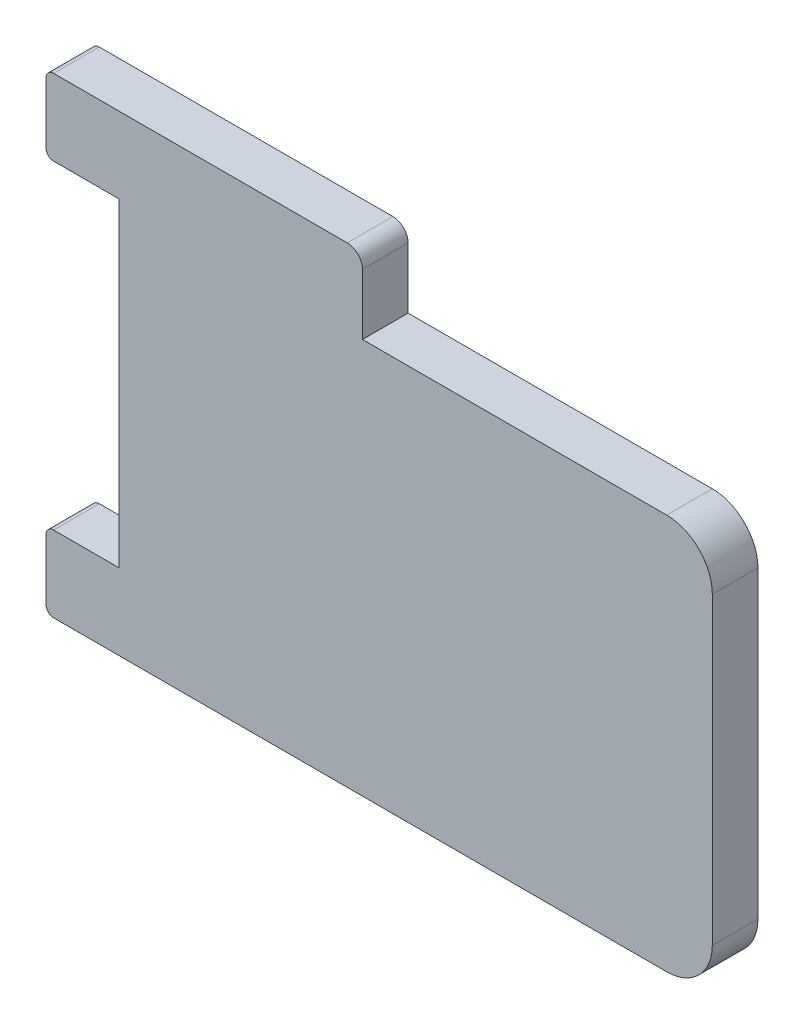
ISO-10303-21;
HEADER;
FILE_DESCRIPTION(('STEP AP214'),'2;1');
FILE_NAME('part.step','',(''),(''),'','','');
FILE_SCHEMA(('AUTOMOTIVE_DESIGN { 1 0 10303 214 1 1 1 1 }'));
ENDSEC;
DATA;
#1=APPLICATION_CONTEXT('core data for automotive mechanical design processes');
#2=APPLICATION_PROTOCOL_DEFINITION('international standard','automotive_design',2000,#1);
#3=PRODUCT_CONTEXT('',#1,'mechanical');
#4=PRODUCT('Part','Part','',(#3));
#5=PRODUCT_RELATED_PRODUCT_CATEGORY('part','',(#4));
#6=PRODUCT_DEFINITION_FORMATION('','',#4);
#7=PRODUCT_DEFINITION_CONTEXT('part definition',#1,'design');
#8=PRODUCT_DEFINITION('design','',#6,#7);
#9=PRODUCT_DEFINITION_SHAPE('','',#8);
#10=(LENGTH_UNIT() NAMED_UNIT(*) SI_UNIT(.MILLI.,.METRE.));
#11=(NAMED_UNIT(*) PLANE_ANGLE_UNIT() SI_UNIT($,.RADIAN.));
#12=(NAMED_UNIT(*) SI_UNIT($,.STERADIAN.) SOLID_ANGLE_UNIT());
#13=UNCERTAINTY_MEASURE_WITH_UNIT(LENGTH_MEASURE(1.E-05),#10,'distance_accuracy_value','');
#14=(GEOMETRIC_REPRESENTATION_CONTEXT(3) GLOBAL_UNCERTAINTY_ASSIGNED_CONTEXT((#13)) GLOBAL_UNIT_ASSIGNED_CONTEXT((#10,
#11,#12)) REPRESENTATION_CONTEXT('',''));
#15=CARTESIAN_POINT('',(0.,0.,0.));
#16=DIRECTION('',(0.,0.,1.));
#17=DIRECTION('',(1.,0.,0.));
#18=AXIS2_PLACEMENT_3D('',#15,#16,#17);
#19=CARTESIAN_POINT('',(-19.5,0.,3.));
#20=DIRECTION('',(1.,0.,0.));
#21=DIRECTION('',(0.,0.,-1.));
#22=AXIS2_PLACEMENT_3D('',#19,#20,#21);
#23=PLANE('',#22);
#24=DIRECTION('',(0.,0.,1.));
#25=VECTOR('',#24,1.);
#26=CARTESIAN_POINT('',(-19.5,10.5,3.));
#27=LINE('',#26,#25);
#28=CARTESIAN_POINT('',(-19.5,10.5,0.));
#29=VERTEX_POINT('',#28);
#30=CARTESIAN_POINT('',(-19.5,10.5,3.));
#31=VERTEX_POINT('',#30);
#32=EDGE_CURVE('E220',#29,#31,#27,.T.);
#33=ORIENTED_EDGE('',*,*,#32,.F.);
#34=DIRECTION('',(0.,-1.,0.));
#35=VECTOR('',#34,1.);
#36=CARTESIAN_POINT('',(-19.5,0.,0.));
#37=LINE('',#36,#35);
#38=CARTESIAN_POINT('',(-19.5,-10.5,0.));
#39=VERTEX_POINT('',#38);
#40=EDGE_CURVE('E294',#29,#39,#37,.T.);
#41=ORIENTED_EDGE('',*,*,#40,.T.);
#42=DIRECTION('',(0.,0.,-1.));
#43=VECTOR('',#42,1.);
#44=CARTESIAN_POINT('',(-19.5,-10.5,3.));
#45=LINE('',#44,#43);
#46=CARTESIAN_POINT('',(-19.5,-10.5,3.));
#47=VERTEX_POINT('',#46);
#48=EDGE_CURVE('E313',#47,#39,#45,.T.);
#49=ORIENTED_EDGE('',*,*,#48,.F.);
#50=DIRECTION('',(0.,-1.,0.));
#51=VECTOR('',#50,1.);
#52=CARTESIAN_POINT('',(-19.5,0.,3.));
#53=LINE('',#52,#51);
#54=EDGE_CURVE('E257',#31,#47,#53,.T.);
#55=ORIENTED_EDGE('',*,*,#54,.F.);
#56=EDGE_LOOP('',(#33,#41,#49,#55));
#57=FACE_BOUND('',#56,.T.);
#58=ADVANCED_FACE('F88',(#57),#23,.F.);
#59=CARTESIAN_POINT('',(19.5,0.,3.));
#60=DIRECTION('',(1.,0.,0.));
#61=DIRECTION('',(0.,1.,0.));
#62=AXIS2_PLACEMENT_3D('',#59,#60,#61);
#63=PLANE('',#62);
#64=DIRECTION('',(0.,-1.,0.));
#65=VECTOR('',#64,1.);
#66=CARTESIAN_POINT('',(19.5,0.,0.));
#67=LINE('',#66,#65);
#68=CARTESIAN_POINT('',(19.5,7.5,0.));
#69=VERTEX_POINT('',#68);
#70=CARTESIAN_POINT('',(19.5,-12.5,0.));
#71=VERTEX_POINT('',#70);
#72=EDGE_CURVE('E215',#69,#71,#67,.T.);
#73=ORIENTED_EDGE('',*,*,#72,.F.);
#74=DIRECTION('',(0.,0.,-1.));
#75=VECTOR('',#74,1.);
#76=CARTESIAN_POINT('',(19.5,7.5,3.));
#77=LINE('',#76,#75);
#78=CARTESIAN_POINT('',(19.5,7.5,3.));
#79=VERTEX_POINT('',#78);
#80=EDGE_CURVE('E209',#79,#69,#77,.T.);
#81=ORIENTED_EDGE('',*,*,#80,.F.);
#82=DIRECTION('',(0.,-1.,0.));
#83=VECTOR('',#82,1.);
#84=CARTESIAN_POINT('',(19.5,0.,3.));
#85=LINE('',#84,#83);
#86=CARTESIAN_POINT('',(19.5,-12.5,3.));
#87=VERTEX_POINT('',#86);
#88=EDGE_CURVE('E213',#79,#87,#85,.T.);
#89=ORIENTED_EDGE('',*,*,#88,.T.);
#90=DIRECTION('',(0.,0.,-1.));
#91=VECTOR('',#90,1.);
#92=CARTESIAN_POINT('',(19.5,-12.5,3.));
#93=LINE('',#92,#91);
#94=EDGE_CURVE('E272',#87,#71,#93,.T.);
#95=ORIENTED_EDGE('',*,*,#94,.T.);
#96=EDGE_LOOP('',(#73,#81,#89,#95));
#97=FACE_BOUND('',#96,.T.);
#98=ADVANCED_FACE('F211',(#97),#63,.T.);
#99=CARTESIAN_POINT('',(16.5,7.5,3.));
#100=DIRECTION('',(0.,0.,-1.));
#101=DIRECTION('',(-1.,0.,0.));
#102=AXIS2_PLACEMENT_3D('',#99,#100,#101);
#103=CYLINDRICAL_SURFACE('',#102,3.);
#104=CARTESIAN_POINT('',(16.5,7.5,0.));
#105=DIRECTION('',(0.,0.,1.));
#106=DIRECTION('',(1.,0.,0.));
#107=AXIS2_PLACEMENT_3D('',#104,#105,#106);
#108=CIRCLE('',#107,3.);
#109=CARTESIAN_POINT('',(16.5,10.5,0.));
#110=VERTEX_POINT('',#109);
#111=EDGE_CURVE('E275',#69,#110,#108,.T.);
#112=ORIENTED_EDGE('',*,*,#111,.T.);
#113=DIRECTION('',(0.,0.,-1.));
#114=VECTOR('',#113,1.);
#115=CARTESIAN_POINT('',(16.5,10.5,3.));
#116=LINE('',#115,#114);
#117=CARTESIAN_POINT('',(16.5,10.5,3.));
#118=VERTEX_POINT('',#117);
#119=EDGE_CURVE('E221',#118,#110,#116,.T.);
#120=ORIENTED_EDGE('',*,*,#119,.F.);
#121=CARTESIAN_POINT('',(16.5,7.5,3.));
#122=DIRECTION('',(0.,0.,1.));
#123=DIRECTION('',(1.,0.,0.));
#124=AXIS2_PLACEMENT_3D('',#121,#122,#123);
#125=CIRCLE('',#124,3.);
#126=EDGE_CURVE('E224',#79,#118,#125,.T.);
#127=ORIENTED_EDGE('',*,*,#126,.F.);
#128=ORIENTED_EDGE('',*,*,#80,.T.);
#129=EDGE_LOOP('',(#112,#120,#127,#128));
#130=FACE_BOUND('',#129,.T.);
#131=ADVANCED_FACE('F225',(#130),#103,.T.);
#132=CARTESIAN_POINT('',(0.,10.5,3.));
#133=DIRECTION('',(0.,1.,0.));
#134=DIRECTION('',(0.,0.,1.));
#135=AXIS2_PLACEMENT_3D('',#132,#133,#134);
#136=PLANE('',#135);
#137=DIRECTION('',(1.,0.,0.));
#138=VECTOR('',#137,1.);
#139=CARTESIAN_POINT('',(0.,10.5,0.));
#140=LINE('',#139,#138);
#141=CARTESIAN_POINT('',(-3.5,10.5,0.));
#142=VERTEX_POINT('',#141);
#143=EDGE_CURVE('E279',#142,#110,#140,.T.);
#144=ORIENTED_EDGE('',*,*,#143,.F.);
#145=DIRECTION('',(0.,0.,-1.));
#146=VECTOR('',#145,1.);
#147=CARTESIAN_POINT('',(-3.5,10.5,3.));
#148=LINE('',#147,#146);
#149=CARTESIAN_POINT('',(-3.5,10.5,3.));
#150=VERTEX_POINT('',#149);
#151=EDGE_CURVE('E324',#150,#142,#148,.T.);
#152=ORIENTED_EDGE('',*,*,#151,.F.);
#153=DIRECTION('',(1.,0.,0.));
#154=VECTOR('',#153,1.);
#155=CARTESIAN_POINT('',(0.,10.5,3.));
#156=LINE('',#155,#154);
#157=EDGE_CURVE('E229',#150,#118,#156,.T.);
#158=ORIENTED_EDGE('',*,*,#157,.T.);
#159=ORIENTED_EDGE('',*,*,#119,.T.);
#160=EDGE_LOOP('',(#144,#152,#158,#159));
#161=FACE_BOUND('',#160,.T.);
#162=ADVANCED_FACE('F434',(#161),#136,.T.);
#163=CARTESIAN_POINT('',(-3.5,0.,3.));
#164=DIRECTION('',(1.,0.,0.));
#165=DIRECTION('',(0.,0.,-1.));
#166=AXIS2_PLACEMENT_3D('',#163,#164,#165);
#167=PLANE('',#166);
#168=DIRECTION('',(0.,-1.,0.));
#169=VECTOR('',#168,1.);
#170=CARTESIAN_POINT('',(-3.5,0.,0.));
#171=LINE('',#170,#169);
#172=CARTESIAN_POINT('',(-3.5,14.5,0.));
#173=VERTEX_POINT('',#172);
#174=EDGE_CURVE('E283',#173,#142,#171,.T.);
#175=ORIENTED_EDGE('',*,*,#174,.F.);
#176=DIRECTION('',(0.,0.,-1.));
#177=VECTOR('',#176,1.);
#178=CARTESIAN_POINT('',(-3.5,14.5,3.));
#179=LINE('',#178,#177);
#180=CARTESIAN_POINT('',(-3.5,14.5,3.));
#181=VERTEX_POINT('',#180);
#182=EDGE_CURVE('E321',#181,#173,#179,.T.);
#183=ORIENTED_EDGE('',*,*,#182,.F.);
#184=DIRECTION('',(0.,-1.,0.));
#185=VECTOR('',#184,1.);
#186=CARTESIAN_POINT('',(-3.5,0.,3.));
#187=LINE('',#186,#185);
#188=EDGE_CURVE('E246',#181,#150,#187,.T.);
#189=ORIENTED_EDGE('',*,*,#188,.T.);
#190=ORIENTED_EDGE('',*,*,#151,.T.);
#191=EDGE_LOOP('',(#175,#183,#189,#190));
#192=FACE_BOUND('',#191,.T.);
#193=ADVANCED_FACE('F438',(#192),#167,.T.);
#194=CARTESIAN_POINT('',(-4.5,14.5,3.));
#195=DIRECTION('',(0.,0.,-1.));
#196=DIRECTION('',(-1.,0.,0.));
#197=AXIS2_PLACEMENT_3D('',#194,#195,#196);
#198=CYLINDRICAL_SURFACE('',#197,1.);
#199=CARTESIAN_POINT('',(-4.5,14.5,0.));
#200=DIRECTION('',(0.,0.,1.));
#201=DIRECTION('',(1.,0.,0.));
#202=AXIS2_PLACEMENT_3D('',#199,#200,#201);
#203=CIRCLE('',#202,1.);
#204=CARTESIAN_POINT('',(-4.5,15.5,0.));
#205=VERTEX_POINT('',#204);
#206=EDGE_CURVE('E287',#205,#173,#203,.F.);
#207=ORIENTED_EDGE('',*,*,#206,.F.);
#208=DIRECTION('',(0.,0.,-1.));
#209=VECTOR('',#208,1.);
#210=CARTESIAN_POINT('',(-4.5,15.5,3.));
#211=LINE('',#210,#209);
#212=CARTESIAN_POINT('',(-4.5,15.5,3.));
#213=VERTEX_POINT('',#212);
#214=EDGE_CURVE('E317',#213,#205,#211,.T.);
#215=ORIENTED_EDGE('',*,*,#214,.F.);
#216=CARTESIAN_POINT('',(-4.5,14.5,3.));
#217=DIRECTION('',(0.,0.,1.));
#218=DIRECTION('',(1.,0.,0.));
#219=AXIS2_PLACEMENT_3D('',#216,#217,#218);
#220=CIRCLE('',#219,1.);
#221=EDGE_CURVE('E250',#213,#181,#220,.F.);
#222=ORIENTED_EDGE('',*,*,#221,.T.);
#223=ORIENTED_EDGE('',*,*,#182,.T.);
#224=EDGE_LOOP('',(#207,#215,#222,#223));
#225=FACE_BOUND('',#224,.T.);
#226=ADVANCED_FACE('F441',(#225),#198,.T.);
#227=CARTESIAN_POINT('',(0.,15.5,3.));
#228=DIRECTION('',(0.,1.,0.));
#229=DIRECTION('',(0.,0.,1.));
#230=AXIS2_PLACEMENT_3D('',#227,#228,#229);
#231=PLANE('',#230);
#232=DIRECTION('',(1.,0.,0.));
#233=VECTOR('',#232,1.);
#234=CARTESIAN_POINT('',(0.,15.5,0.));
#235=LINE('',#234,#233);
#236=CARTESIAN_POINT('',(-23.8,15.5,0.));
#237=VERTEX_POINT('',#236);
#238=EDGE_CURVE('E291',#237,#205,#235,.T.);
#239=ORIENTED_EDGE('',*,*,#238,.F.);
#240=DIRECTION('',(0.,0.,-1.));
#241=VECTOR('',#240,1.);
#242=CARTESIAN_POINT('',(-23.8,15.5,3.));
#243=LINE('',#242,#241);
#244=CARTESIAN_POINT('',(-23.8,15.5,3.));
#245=VERTEX_POINT('',#244);
#246=EDGE_CURVE('E12',#237,#245,#243,.F.);
#247=ORIENTED_EDGE('',*,*,#246,.T.);
#248=DIRECTION('',(1.,0.,0.));
#249=VECTOR('',#248,1.);
#250=CARTESIAN_POINT('',(0.,15.5,3.));
#251=LINE('',#250,#249);
#252=EDGE_CURVE('E254',#245,#213,#251,.T.);
#253=ORIENTED_EDGE('',*,*,#252,.T.);
#254=ORIENTED_EDGE('',*,*,#214,.T.);
#255=EDGE_LOOP('',(#239,#247,#253,#254));
#256=FACE_BOUND('',#255,.T.);
#257=ADVANCED_FACE('F447',(#256),#231,.T.);
#258=CARTESIAN_POINT('',(0.,-10.5,3.));
#259=DIRECTION('',(0.,1.,0.));
#260=DIRECTION('',(0.,0.,1.));
#261=AXIS2_PLACEMENT_3D('',#258,#259,#260);
#262=PLANE('',#261);
#263=DIRECTION('',(1.,0.,0.));
#264=VECTOR('',#263,1.);
#265=CARTESIAN_POINT('',(0.,-10.5,0.));
#266=LINE('',#265,#264);
#267=CARTESIAN_POINT('',(-23.8,-10.5,0.));
#268=VERTEX_POINT('',#267);
#269=EDGE_CURVE('E298',#268,#39,#266,.T.);
#270=ORIENTED_EDGE('',*,*,#269,.F.);
#271=DIRECTION('',(0.,0.,-1.));
#272=VECTOR('',#271,1.);
#273=CARTESIAN_POINT('',(-23.8,-10.5,3.));
#274=LINE('',#273,#272);
#275=CARTESIAN_POINT('',(-23.8,-10.5,3.));
#276=VERTEX_POINT('',#275);
#277=EDGE_CURVE('E104',#268,#276,#274,.F.);
#278=ORIENTED_EDGE('',*,*,#277,.T.);
#279=DIRECTION('',(1.,0.,0.));
#280=VECTOR('',#279,1.);
#281=CARTESIAN_POINT('',(0.,-10.5,3.));
#282=LINE('',#281,#280);
#283=EDGE_CURVE('E261',#276,#47,#282,.T.);
#284=ORIENTED_EDGE('',*,*,#283,.T.);
#285=ORIENTED_EDGE('',*,*,#48,.T.);
#286=EDGE_LOOP('',(#270,#278,#284,#285));
#287=FACE_BOUND('',#286,.T.);
#288=ADVANCED_FACE('F410',(#287),#262,.T.);
#289=CARTESIAN_POINT('',(-24.3,0.,3.));
#290=DIRECTION('',(1.,0.,0.));
#291=DIRECTION('',(0.,0.,-1.));
#292=AXIS2_PLACEMENT_3D('',#289,#290,#291);
#293=PLANE('',#292);
#294=DIRECTION('',(0.,-1.,0.));
#295=VECTOR('',#294,1.);
#296=CARTESIAN_POINT('',(-24.3,0.,0.));
#297=LINE('',#296,#295);
#298=CARTESIAN_POINT('',(-24.3,-11.,0.));
#299=VERTEX_POINT('',#298);
#300=CARTESIAN_POINT('',(-24.3,-15.,0.));
#301=VERTEX_POINT('',#300);
#302=EDGE_CURVE('E301',#299,#301,#297,.T.);
#303=ORIENTED_EDGE('',*,*,#302,.T.);
#304=DIRECTION('',(0.,0.,-1.));
#305=VECTOR('',#304,1.);
#306=CARTESIAN_POINT('',(-24.3,-15.,3.));
#307=LINE('',#306,#305);
#308=CARTESIAN_POINT('',(-24.3,-15.,3.));
#309=VERTEX_POINT('',#308);
#310=EDGE_CURVE('E364',#301,#309,#307,.F.);
#311=ORIENTED_EDGE('',*,*,#310,.T.);
#312=DIRECTION('',(0.,-1.,0.));
#313=VECTOR('',#312,1.);
#314=CARTESIAN_POINT('',(-24.3,0.,3.));
#315=LINE('',#314,#313);
#316=CARTESIAN_POINT('',(-24.3,-11.,3.));
#317=VERTEX_POINT('',#316);
#318=EDGE_CURVE('E264',#317,#309,#315,.T.);
#319=ORIENTED_EDGE('',*,*,#318,.F.);
#320=DIRECTION('',(0.,0.,-1.));
#321=VECTOR('',#320,1.);
#322=CARTESIAN_POINT('',(-24.3,-11.,0.));
#323=LINE('',#322,#321);
#324=EDGE_CURVE('E360',#317,#299,#323,.T.);
#325=ORIENTED_EDGE('',*,*,#324,.T.);
#326=EDGE_LOOP('',(#303,#311,#319,#325));
#327=FACE_BOUND('',#326,.T.);
#328=ADVANCED_FACE('F418',(#327),#293,.F.);
#329=CARTESIAN_POINT('',(0.,-15.5,3.));
#330=DIRECTION('',(0.,1.,0.));
#331=DIRECTION('',(0.,0.,1.));
#332=AXIS2_PLACEMENT_3D('',#329,#330,#331);
#333=PLANE('',#332);
#334=DIRECTION('',(1.,0.,0.));
#335=VECTOR('',#334,1.);
#336=CARTESIAN_POINT('',(0.,-15.5,3.));
#337=LINE('',#336,#335);
#338=CARTESIAN_POINT('',(-23.8,-15.5,3.));
#339=VERTEX_POINT('',#338);
#340=CARTESIAN_POINT('',(16.5,-15.5,3.));
#341=VERTEX_POINT('',#340);
#342=EDGE_CURVE('E267',#339,#341,#337,.T.);
#343=ORIENTED_EDGE('',*,*,#342,.F.);
#344=DIRECTION('',(0.,0.,-1.));
#345=VECTOR('',#344,1.);
#346=CARTESIAN_POINT('',(-23.8,-15.5,3.));
#347=LINE('',#346,#345);
#348=CARTESIAN_POINT('',(-23.8,-15.5,0.));
#349=VERTEX_POINT('',#348);
#350=EDGE_CURVE('E332',#339,#349,#347,.T.);
#351=ORIENTED_EDGE('',*,*,#350,.T.);
#352=DIRECTION('',(1.,0.,0.));
#353=VECTOR('',#352,1.);
#354=CARTESIAN_POINT('',(0.,-15.5,0.));
#355=LINE('',#354,#353);
#356=CARTESIAN_POINT('',(16.5,-15.5,0.));
#357=VERTEX_POINT('',#356);
#358=EDGE_CURVE('E241',#349,#357,#355,.T.);
#359=ORIENTED_EDGE('',*,*,#358,.T.);
#360=DIRECTION('',(0.,0.,-1.));
#361=VECTOR('',#360,1.);
#362=CARTESIAN_POINT('',(16.5,-15.5,3.));
#363=LINE('',#362,#361);
#364=EDGE_CURVE('E309',#341,#357,#363,.T.);
#365=ORIENTED_EDGE('',*,*,#364,.F.);
#366=EDGE_LOOP('',(#343,#351,#359,#365));
#367=FACE_BOUND('',#366,.T.);
#368=ADVANCED_FACE('F427',(#367),#333,.F.);
#369=CARTESIAN_POINT('',(16.5,-12.5,3.));
#370=DIRECTION('',(0.,0.,-1.));
#371=DIRECTION('',(-1.,0.,0.));
#372=AXIS2_PLACEMENT_3D('',#369,#370,#371);
#373=CYLINDRICAL_SURFACE('',#372,3.);
#374=CARTESIAN_POINT('',(16.5,-12.5,0.));
#375=DIRECTION('',(0.,0.,1.));
#376=DIRECTION('',(1.,0.,0.));
#377=AXIS2_PLACEMENT_3D('',#374,#375,#376);
#378=CIRCLE('',#377,3.);
#379=EDGE_CURVE('E237',#357,#71,#378,.T.);
#380=ORIENTED_EDGE('',*,*,#379,.T.);
#381=ORIENTED_EDGE('',*,*,#94,.F.);
#382=CARTESIAN_POINT('',(16.5,-12.5,3.));
#383=DIRECTION('',(0.,0.,1.));
#384=DIRECTION('',(1.,0.,0.));
#385=AXIS2_PLACEMENT_3D('',#382,#383,#384);
#386=CIRCLE('',#385,3.);
#387=EDGE_CURVE('E234',#341,#87,#386,.T.);
#388=ORIENTED_EDGE('',*,*,#387,.F.);
#389=ORIENTED_EDGE('',*,*,#364,.T.);
#390=EDGE_LOOP('',(#380,#381,#388,#389));
#391=FACE_BOUND('',#390,.T.);
#392=ADVANCED_FACE('F430',(#391),#373,.T.);
#393=CARTESIAN_POINT('',(0.,0.,3.));
#394=DIRECTION('',(0.,0.,1.));
#395=DIRECTION('',(1.,0.,0.));
#396=AXIS2_PLACEMENT_3D('',#393,#394,#395);
#397=PLANE('',#396);
#398=ORIENTED_EDGE('',*,*,#318,.T.);
#399=CARTESIAN_POINT('',(-23.8,-15.,3.));
#400=DIRECTION('',(0.,0.,1.));
#401=DIRECTION('',(1.,0.,0.));
#402=AXIS2_PLACEMENT_3D('',#399,#400,#401);
#403=CIRCLE('',#402,0.5);
#404=EDGE_CURVE('E375',#309,#339,#403,.T.);
#405=ORIENTED_EDGE('',*,*,#404,.T.);
#406=ORIENTED_EDGE('',*,*,#342,.T.);
#407=ORIENTED_EDGE('',*,*,#387,.T.);
#408=ORIENTED_EDGE('',*,*,#88,.F.);
#409=ORIENTED_EDGE('',*,*,#126,.T.);
#410=ORIENTED_EDGE('',*,*,#157,.F.);
#411=ORIENTED_EDGE('',*,*,#188,.F.);
#412=ORIENTED_EDGE('',*,*,#221,.F.);
#413=ORIENTED_EDGE('',*,*,#252,.F.);
#414=CARTESIAN_POINT('',(-23.8,15.,3.));
#415=DIRECTION('',(0.,0.,1.));
#416=DIRECTION('',(1.,0.,0.));
#417=AXIS2_PLACEMENT_3D('',#414,#415,#416);
#418=CIRCLE('',#417,0.5);
#419=CARTESIAN_POINT('',(-24.3,15.,3.));
#420=VERTEX_POINT('',#419);
#421=EDGE_CURVE('E367',#245,#420,#418,.T.);
#422=ORIENTED_EDGE('',*,*,#421,.T.);
#423=DIRECTION('',(0.,-1.,0.));
#424=VECTOR('',#423,1.);
#425=CARTESIAN_POINT('',(-24.3,15.5,3.));
#426=LINE('',#425,#424);
#427=CARTESIAN_POINT('',(-24.3,11.,3.));
#428=VERTEX_POINT('',#427);
#429=EDGE_CURVE('E276',#420,#428,#426,.T.);
#430=ORIENTED_EDGE('',*,*,#429,.T.);
#431=CARTESIAN_POINT('',(-23.8,11.,3.));
#432=DIRECTION('',(0.,0.,1.));
#433=DIRECTION('',(1.,0.,0.));
#434=AXIS2_PLACEMENT_3D('',#431,#432,#433);
#435=CIRCLE('',#434,0.5);
#436=CARTESIAN_POINT('',(-23.8,10.5,3.));
#437=VERTEX_POINT('',#436);
#438=EDGE_CURVE('E112',#428,#437,#435,.T.);
#439=ORIENTED_EDGE('',*,*,#438,.T.);
#440=DIRECTION('',(1.,0.,0.));
#441=VECTOR('',#440,1.);
#442=CARTESIAN_POINT('',(-24.3,10.5,3.));
#443=LINE('',#442,#441);
#444=EDGE_CURVE('E333',#437,#31,#443,.T.);
#445=ORIENTED_EDGE('',*,*,#444,.T.);
#446=ORIENTED_EDGE('',*,*,#54,.T.);
#447=ORIENTED_EDGE('',*,*,#283,.F.);
#448=CARTESIAN_POINT('',(-23.8,-11.,3.));
#449=DIRECTION('',(0.,0.,1.));
#450=DIRECTION('',(1.,0.,0.));
#451=AXIS2_PLACEMENT_3D('',#448,#449,#450);
#452=CIRCLE('',#451,0.5);
#453=EDGE_CURVE('E372',#276,#317,#452,.T.);
#454=ORIENTED_EDGE('',*,*,#453,.T.);
#455=EDGE_LOOP('',(#398,#405,#406,#407,#408,#409,#410,#411,#412,#413,#422,#430,#439,#445,#446,
#447,#454));
#456=FACE_BOUND('',#455,.T.);
#457=ADVANCED_FACE('F232',(#456),#397,.T.);
#458=CARTESIAN_POINT('',(0.,0.,0.));
#459=DIRECTION('',(0.,0.,1.));
#460=DIRECTION('',(1.,0.,0.));
#461=AXIS2_PLACEMENT_3D('',#458,#459,#460);
#462=PLANE('',#461);
#463=ORIENTED_EDGE('',*,*,#358,.F.);
#464=CARTESIAN_POINT('',(-23.8,-15.,0.));
#465=DIRECTION('',(0.,0.,1.));
#466=DIRECTION('',(1.,0.,0.));
#467=AXIS2_PLACEMENT_3D('',#464,#465,#466);
#468=CIRCLE('',#467,0.5);
#469=EDGE_CURVE('E357',#349,#301,#468,.F.);
#470=ORIENTED_EDGE('',*,*,#469,.T.);
#471=ORIENTED_EDGE('',*,*,#302,.F.);
#472=CARTESIAN_POINT('',(-23.8,-11.,0.));
#473=DIRECTION('',(0.,0.,1.));
#474=DIRECTION('',(1.,0.,0.));
#475=AXIS2_PLACEMENT_3D('',#472,#473,#474);
#476=CIRCLE('',#475,0.5);
#477=EDGE_CURVE('E354',#299,#268,#476,.F.);
#478=ORIENTED_EDGE('',*,*,#477,.T.);
#479=ORIENTED_EDGE('',*,*,#269,.T.);
#480=ORIENTED_EDGE('',*,*,#40,.F.);
#481=DIRECTION('',(1.,0.,0.));
#482=VECTOR('',#481,1.);
#483=CARTESIAN_POINT('',(-24.3,10.5,0.));
#484=LINE('',#483,#482);
#485=CARTESIAN_POINT('',(-23.8,10.5,0.));
#486=VERTEX_POINT('',#485);
#487=EDGE_CURVE('E339',#486,#29,#484,.T.);
#488=ORIENTED_EDGE('',*,*,#487,.F.);
#489=CARTESIAN_POINT('',(-23.8,11.,0.));
#490=DIRECTION('',(0.,0.,1.));
#491=DIRECTION('',(1.,0.,0.));
#492=AXIS2_PLACEMENT_3D('',#489,#490,#491);
#493=CIRCLE('',#492,0.5);
#494=CARTESIAN_POINT('',(-24.3,11.,0.));
#495=VERTEX_POINT('',#494);
#496=EDGE_CURVE('E351',#486,#495,#493,.F.);
#497=ORIENTED_EDGE('',*,*,#496,.T.);
#498=DIRECTION('',(0.,-1.,0.));
#499=VECTOR('',#498,1.);
#500=CARTESIAN_POINT('',(-24.3,15.5,0.));
#501=LINE('',#500,#499);
#502=CARTESIAN_POINT('',(-24.3,15.,0.));
#503=VERTEX_POINT('',#502);
#504=EDGE_CURVE('E336',#503,#495,#501,.T.);
#505=ORIENTED_EDGE('',*,*,#504,.F.);
#506=CARTESIAN_POINT('',(-23.8,15.,0.));
#507=DIRECTION('',(0.,0.,1.));
#508=DIRECTION('',(1.,0.,0.));
#509=AXIS2_PLACEMENT_3D('',#506,#507,#508);
#510=CIRCLE('',#509,0.5);
#511=EDGE_CURVE('E348',#503,#237,#510,.F.);
#512=ORIENTED_EDGE('',*,*,#511,.T.);
#513=ORIENTED_EDGE('',*,*,#238,.T.);
#514=ORIENTED_EDGE('',*,*,#206,.T.);
#515=ORIENTED_EDGE('',*,*,#174,.T.);
#516=ORIENTED_EDGE('',*,*,#143,.T.);
#517=ORIENTED_EDGE('',*,*,#111,.F.);
#518=ORIENTED_EDGE('',*,*,#72,.T.);
#519=ORIENTED_EDGE('',*,*,#379,.F.);
#520=EDGE_LOOP('',(#463,#470,#471,#478,#479,#480,#488,#497,#505,#512,#513,#514,#515,#516,#517,
#518,#519));
#521=FACE_BOUND('',#520,.T.);
#522=ADVANCED_FACE('F406',(#521),#462,.F.);
#523=CARTESIAN_POINT('',(-24.3,15.5,3.));
#524=DIRECTION('',(1.,0.,0.));
#525=DIRECTION('',(0.,0.,-1.));
#526=AXIS2_PLACEMENT_3D('',#523,#524,#525);
#527=PLANE('',#526);
#528=ORIENTED_EDGE('',*,*,#504,.T.);
#529=DIRECTION('',(0.,0.,-1.));
#530=VECTOR('',#529,1.);
#531=CARTESIAN_POINT('',(-24.3,11.,3.));
#532=LINE('',#531,#530);
#533=EDGE_CURVE('E97',#495,#428,#532,.F.);
#534=ORIENTED_EDGE('',*,*,#533,.T.);
#535=ORIENTED_EDGE('',*,*,#429,.F.);
#536=DIRECTION('',(0.,0.,-1.));
#537=VECTOR('',#536,1.);
#538=CARTESIAN_POINT('',(-24.3,15.,0.));
#539=LINE('',#538,#537);
#540=EDGE_CURVE('E384',#420,#503,#539,.T.);
#541=ORIENTED_EDGE('',*,*,#540,.T.);
#542=EDGE_LOOP('',(#528,#534,#535,#541));
#543=FACE_BOUND('',#542,.T.);
#544=ADVANCED_FACE('F391',(#543),#527,.F.);
#545=CARTESIAN_POINT('',(-24.3,10.5,3.));
#546=DIRECTION('',(0.,1.,0.));
#547=DIRECTION('',(0.,0.,1.));
#548=AXIS2_PLACEMENT_3D('',#545,#546,#547);
#549=PLANE('',#548);
#550=ORIENTED_EDGE('',*,*,#444,.F.);
#551=DIRECTION('',(0.,0.,-1.));
#552=VECTOR('',#551,1.);
#553=CARTESIAN_POINT('',(-23.8,10.5,3.));
#554=LINE('',#553,#552);
#555=EDGE_CURVE('E380',#437,#486,#554,.T.);
#556=ORIENTED_EDGE('',*,*,#555,.T.);
#557=ORIENTED_EDGE('',*,*,#487,.T.);
#558=ORIENTED_EDGE('',*,*,#32,.T.);
#559=EDGE_LOOP('',(#550,#556,#557,#558));
#560=FACE_BOUND('',#559,.T.);
#561=ADVANCED_FACE('F401',(#560),#549,.F.);
#562=CARTESIAN_POINT('',(-23.8,-15.,3.));
#563=DIRECTION('',(0.,0.,-1.));
#564=DIRECTION('',(-1.,0.,0.));
#565=AXIS2_PLACEMENT_3D('',#562,#563,#564);
#566=CYLINDRICAL_SURFACE('',#565,0.5);
#567=ORIENTED_EDGE('',*,*,#404,.F.);
#568=ORIENTED_EDGE('',*,*,#310,.F.);
#569=ORIENTED_EDGE('',*,*,#469,.F.);
#570=ORIENTED_EDGE('',*,*,#350,.F.);
#571=EDGE_LOOP('',(#567,#568,#569,#570));
#572=FACE_BOUND('',#571,.T.);
#573=ADVANCED_FACE('F424',(#572),#566,.T.);
#574=CARTESIAN_POINT('',(-23.8,-11.,3.));
#575=DIRECTION('',(0.,0.,1.));
#576=DIRECTION('',(1.,0.,0.));
#577=AXIS2_PLACEMENT_3D('',#574,#575,#576);
#578=CYLINDRICAL_SURFACE('',#577,0.5);
#579=ORIENTED_EDGE('',*,*,#453,.F.);
#580=ORIENTED_EDGE('',*,*,#277,.F.);
#581=ORIENTED_EDGE('',*,*,#477,.F.);
#582=ORIENTED_EDGE('',*,*,#324,.F.);
#583=EDGE_LOOP('',(#579,#580,#581,#582));
#584=FACE_BOUND('',#583,.T.);
#585=ADVANCED_FACE('F415',(#584),#578,.T.);
#586=CARTESIAN_POINT('',(-23.8,11.,3.));
#587=DIRECTION('',(0.,0.,-1.));
#588=DIRECTION('',(-1.,0.,0.));
#589=AXIS2_PLACEMENT_3D('',#586,#587,#588);
#590=CYLINDRICAL_SURFACE('',#589,0.5);
#591=ORIENTED_EDGE('',*,*,#438,.F.);
#592=ORIENTED_EDGE('',*,*,#533,.F.);
#593=ORIENTED_EDGE('',*,*,#496,.F.);
#594=ORIENTED_EDGE('',*,*,#555,.F.);
#595=EDGE_LOOP('',(#591,#592,#593,#594));
#596=FACE_BOUND('',#595,.T.);
#597=ADVANCED_FACE('F398',(#596),#590,.T.);
#598=CARTESIAN_POINT('',(-23.8,15.,3.));
#599=DIRECTION('',(0.,0.,1.));
#600=DIRECTION('',(1.,0.,0.));
#601=AXIS2_PLACEMENT_3D('',#598,#599,#600);
#602=CYLINDRICAL_SURFACE('',#601,0.5);
#603=ORIENTED_EDGE('',*,*,#421,.F.);
#604=ORIENTED_EDGE('',*,*,#246,.F.);
#605=ORIENTED_EDGE('',*,*,#511,.F.);
#606=ORIENTED_EDGE('',*,*,#540,.F.);
#607=EDGE_LOOP('',(#603,#604,#605,#606));
#608=FACE_BOUND('',#607,.T.);
#609=ADVANCED_FACE('F90',(#608),#602,.T.);
#610=CLOSED_SHELL('',(#58,#98,#131,#162,#193,#226,#257,#288,#328,#368,#392,#457,#522,#544,#561,
#573,#585,#597,#609));
#611=MANIFOLD_SOLID_BREP('B2',#610);
#612=ADVANCED_BREP_SHAPE_REPRESENTATION('',(#18,#611),#14);
#613=SHAPE_DEFINITION_REPRESENTATION(#9,#612);
ENDSEC;
END-ISO-10303-21;
